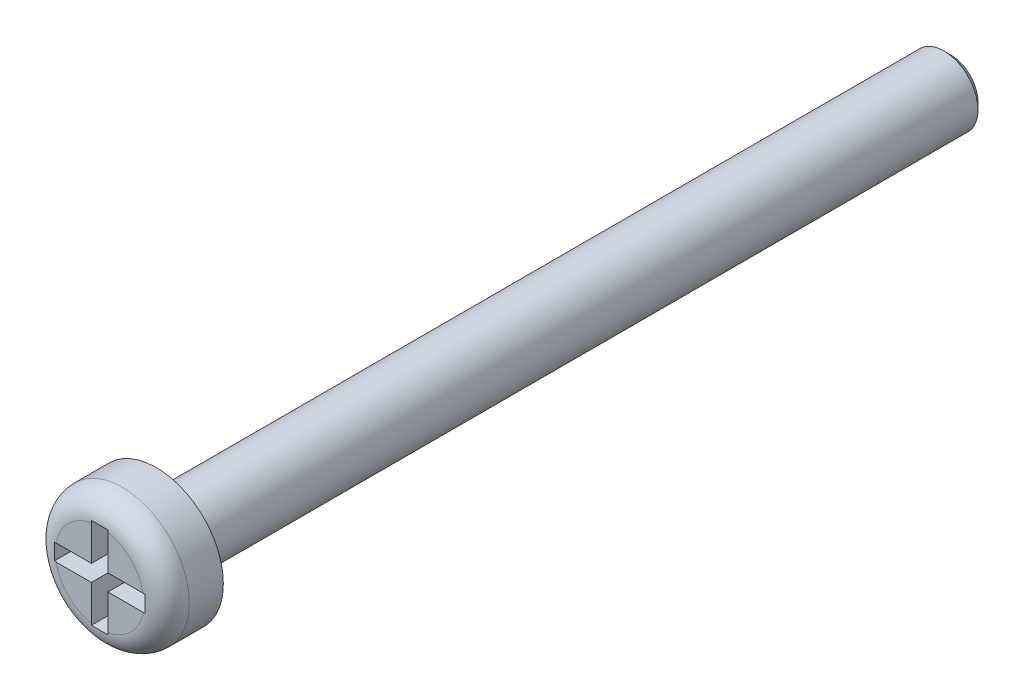
ISO-10303-21;
HEADER;
FILE_DESCRIPTION(('STEP AP214'),'2;1');
FILE_NAME('part.step','',(''),(''),'','','');
FILE_SCHEMA(('AUTOMOTIVE_DESIGN { 1 0 10303 214 1 1 1 1 }'));
ENDSEC;
DATA;
#1=APPLICATION_CONTEXT('core data for automotive mechanical design processes');
#2=APPLICATION_PROTOCOL_DEFINITION('international standard','automotive_design',2000,#1);
#3=PRODUCT_CONTEXT('',#1,'mechanical');
#4=PRODUCT('Part','Part','',(#3));
#5=PRODUCT_RELATED_PRODUCT_CATEGORY('part','',(#4));
#6=PRODUCT_DEFINITION_FORMATION('','',#4);
#7=PRODUCT_DEFINITION_CONTEXT('part definition',#1,'design');
#8=PRODUCT_DEFINITION('design','',#6,#7);
#9=PRODUCT_DEFINITION_SHAPE('','',#8);
#10=(LENGTH_UNIT() NAMED_UNIT(*) SI_UNIT(.MILLI.,.METRE.));
#11=(NAMED_UNIT(*) PLANE_ANGLE_UNIT() SI_UNIT($,.RADIAN.));
#12=(NAMED_UNIT(*) SI_UNIT($,.STERADIAN.) SOLID_ANGLE_UNIT());
#13=UNCERTAINTY_MEASURE_WITH_UNIT(LENGTH_MEASURE(1.E-05),#10,'distance_accuracy_value','');
#14=(GEOMETRIC_REPRESENTATION_CONTEXT(3) GLOBAL_UNCERTAINTY_ASSIGNED_CONTEXT((#13)) GLOBAL_UNIT_ASSIGNED_CONTEXT((#10,
#11,#12)) REPRESENTATION_CONTEXT('',''));
#15=CARTESIAN_POINT('',(0.,0.,0.));
#16=DIRECTION('',(0.,0.,1.));
#17=DIRECTION('',(1.,0.,0.));
#18=AXIS2_PLACEMENT_3D('',#15,#16,#17);
#19=CARTESIAN_POINT('',(0.,0.,2.5));
#20=DIRECTION('',(0.,0.,1.));
#21=DIRECTION('',(1.,0.,0.));
#22=AXIS2_PLACEMENT_3D('',#19,#20,#21);
#23=PLANE('',#22);
#24=DIRECTION('',(0.,-1.,0.));
#25=VECTOR('',#24,1.);
#26=CARTESIAN_POINT('',(-0.363589324194442,0.363589324194443,2.5));
#27=LINE('',#26,#25);
#28=CARTESIAN_POINT('',(-0.363589324194442,1.915803435463,2.5));
#29=VERTEX_POINT('',#28);
#30=CARTESIAN_POINT('',(-0.363589324194442,0.363589324194443,2.5));
#31=VERTEX_POINT('',#30);
#32=EDGE_CURVE('E215',#29,#31,#27,.T.);
#33=ORIENTED_EDGE('',*,*,#32,.F.);
#34=CARTESIAN_POINT('',(0.,0.,2.5));
#35=DIRECTION('',(0.,0.,1.));
#36=DIRECTION('',(1.,0.,0.));
#37=AXIS2_PLACEMENT_3D('',#34,#35,#36);
#38=CIRCLE('',#37,1.95);
#39=CARTESIAN_POINT('',(-1.915803435463,0.363589324194443,2.5));
#40=VERTEX_POINT('',#39);
#41=EDGE_CURVE('E267',#29,#40,#38,.T.);
#42=ORIENTED_EDGE('',*,*,#41,.T.);
#43=DIRECTION('',(-1.,0.,0.));
#44=VECTOR('',#43,1.);
#45=CARTESIAN_POINT('',(-2.,0.363589324194443,2.5));
#46=LINE('',#45,#44);
#47=EDGE_CURVE('E217',#31,#40,#46,.T.);
#48=ORIENTED_EDGE('',*,*,#47,.F.);
#49=EDGE_LOOP('',(#33,#42,#48));
#50=FACE_BOUND('',#49,.T.);
#51=ADVANCED_FACE('F35',(#50),#23,.T.);
#52=DIRECTION('',(1.,0.,0.));
#53=VECTOR('',#52,1.);
#54=CARTESIAN_POINT('',(-2.,-0.363589324194442,2.5));
#55=LINE('',#54,#53);
#56=CARTESIAN_POINT('',(-1.915803435463,-0.363589324194442,2.5));
#57=VERTEX_POINT('',#56);
#58=CARTESIAN_POINT('',(-0.363589324194442,-0.363589324194442,2.5));
#59=VERTEX_POINT('',#58);
#60=EDGE_CURVE('E180',#57,#59,#55,.T.);
#61=ORIENTED_EDGE('',*,*,#60,.F.);
#62=CARTESIAN_POINT('',(0.,0.,2.5));
#63=DIRECTION('',(0.,0.,1.));
#64=DIRECTION('',(1.,0.,0.));
#65=AXIS2_PLACEMENT_3D('',#62,#63,#64);
#66=CIRCLE('',#65,1.95);
#67=CARTESIAN_POINT('',(-0.363589324194442,-1.915803435463,2.5));
#68=VERTEX_POINT('',#67);
#69=EDGE_CURVE('E265',#57,#68,#66,.T.);
#70=ORIENTED_EDGE('',*,*,#69,.T.);
#71=DIRECTION('',(0.,-1.,0.));
#72=VECTOR('',#71,1.);
#73=CARTESIAN_POINT('',(-0.363589324194442,-2.,2.5));
#74=LINE('',#73,#72);
#75=EDGE_CURVE('E177',#59,#68,#74,.T.);
#76=ORIENTED_EDGE('',*,*,#75,.F.);
#77=EDGE_LOOP('',(#61,#70,#76));
#78=FACE_BOUND('',#77,.T.);
#79=ADVANCED_FACE('F384',(#78),#23,.T.);
#80=DIRECTION('',(0.,1.,0.));
#81=VECTOR('',#80,1.);
#82=CARTESIAN_POINT('',(0.363589324194442,-2.,2.5));
#83=LINE('',#82,#81);
#84=CARTESIAN_POINT('',(0.363589324194442,-1.915803435463,2.5));
#85=VERTEX_POINT('',#84);
#86=CARTESIAN_POINT('',(0.363589324194442,-0.363589324194442,2.5));
#87=VERTEX_POINT('',#86);
#88=EDGE_CURVE('E158',#85,#87,#83,.T.);
#89=ORIENTED_EDGE('',*,*,#88,.F.);
#90=CARTESIAN_POINT('',(0.,0.,2.5));
#91=DIRECTION('',(0.,0.,1.));
#92=DIRECTION('',(1.,0.,0.));
#93=AXIS2_PLACEMENT_3D('',#90,#91,#92);
#94=CIRCLE('',#93,1.95);
#95=CARTESIAN_POINT('',(1.915803435463,-0.363589324194442,2.5));
#96=VERTEX_POINT('',#95);
#97=EDGE_CURVE('E263',#85,#96,#94,.T.);
#98=ORIENTED_EDGE('',*,*,#97,.T.);
#99=DIRECTION('',(1.,0.,0.));
#100=VECTOR('',#99,1.);
#101=CARTESIAN_POINT('',(0.363589324194442,-0.363589324194442,2.5));
#102=LINE('',#101,#100);
#103=EDGE_CURVE('E209',#87,#96,#102,.T.);
#104=ORIENTED_EDGE('',*,*,#103,.F.);
#105=EDGE_LOOP('',(#89,#98,#104));
#106=FACE_BOUND('',#105,.T.);
#107=ADVANCED_FACE('F370',(#106),#23,.T.);
#108=CARTESIAN_POINT('',(0.,0.,0.));
#109=DIRECTION('',(0.,0.,1.));
#110=DIRECTION('',(1.,0.,0.));
#111=AXIS2_PLACEMENT_3D('',#108,#109,#110);
#112=PLANE('',#111);
#113=CARTESIAN_POINT('',(0.,0.,0.));
#114=DIRECTION('',(0.,0.,1.));
#115=DIRECTION('',(1.,0.,0.));
#116=AXIS2_PLACEMENT_3D('',#113,#114,#115);
#117=CIRCLE('',#116,2.95);
#118=CARTESIAN_POINT('',(2.95,0.,0.));
#119=VERTEX_POINT('',#118);
#120=EDGE_CURVE('E223',#119,#119,#117,.T.);
#121=ORIENTED_EDGE('',*,*,#120,.F.);
#122=EDGE_LOOP('',(#121));
#123=FACE_BOUND('',#122,.T.);
#124=CARTESIAN_POINT('',(0.,0.,0.));
#125=DIRECTION('',(0.,0.,1.));
#126=DIRECTION('',(1.,0.,0.));
#127=AXIS2_PLACEMENT_3D('',#124,#125,#126);
#128=CIRCLE('',#127,1.5);
#129=CARTESIAN_POINT('',(1.5,0.,0.));
#130=VERTEX_POINT('',#129);
#131=EDGE_CURVE('E252',#130,#130,#128,.F.);
#132=ORIENTED_EDGE('',*,*,#131,.F.);
#133=EDGE_LOOP('',(#132));
#134=FACE_BOUND('',#133,.T.);
#135=ADVANCED_FACE('F371',(#123,#134),#112,.F.);
#136=CARTESIAN_POINT('',(0.,0.,2.5));
#137=DIRECTION('',(0.,0.,-1.));
#138=DIRECTION('',(-1.,0.,0.));
#139=AXIS2_PLACEMENT_3D('',#136,#137,#138);
#140=CYLINDRICAL_SURFACE('',#139,2.95);
#141=CARTESIAN_POINT('',(0.,0.,1.5));
#142=DIRECTION('',(0.,0.,1.));
#143=DIRECTION('',(1.,0.,0.));
#144=AXIS2_PLACEMENT_3D('',#141,#142,#143);
#145=CIRCLE('',#144,2.95);
#146=CARTESIAN_POINT('',(2.95,0.,1.5));
#147=VERTEX_POINT('',#146);
#148=EDGE_CURVE('E11',#147,#147,#145,.F.);
#149=ORIENTED_EDGE('',*,*,#148,.T.);
#150=EDGE_LOOP('',(#149));
#151=FACE_BOUND('',#150,.T.);
#152=ORIENTED_EDGE('',*,*,#120,.T.);
#153=EDGE_LOOP('',(#152));
#154=FACE_BOUND('',#153,.T.);
#155=ADVANCED_FACE('F368',(#151,#154),#140,.T.);
#156=DIRECTION('',(-1.,0.,0.));
#157=VECTOR('',#156,1.);
#158=CARTESIAN_POINT('',(0.363589324194442,0.363589324194443,2.5));
#159=LINE('',#158,#157);
#160=CARTESIAN_POINT('',(1.915803435463,0.363589324194443,2.5));
#161=VERTEX_POINT('',#160);
#162=CARTESIAN_POINT('',(0.363589324194442,0.363589324194443,2.5));
#163=VERTEX_POINT('',#162);
#164=EDGE_CURVE('E211',#161,#163,#159,.T.);
#165=ORIENTED_EDGE('',*,*,#164,.F.);
#166=CARTESIAN_POINT('',(0.,0.,2.5));
#167=DIRECTION('',(0.,0.,1.));
#168=DIRECTION('',(1.,0.,0.));
#169=AXIS2_PLACEMENT_3D('',#166,#167,#168);
#170=CIRCLE('',#169,1.95);
#171=CARTESIAN_POINT('',(0.363589324194442,1.915803435463,2.5));
#172=VERTEX_POINT('',#171);
#173=EDGE_CURVE('E261',#161,#172,#170,.T.);
#174=ORIENTED_EDGE('',*,*,#173,.T.);
#175=DIRECTION('',(0.,1.,0.));
#176=VECTOR('',#175,1.);
#177=CARTESIAN_POINT('',(0.363589324194442,0.363589324194443,2.5));
#178=LINE('',#177,#176);
#179=EDGE_CURVE('E213',#163,#172,#178,.T.);
#180=ORIENTED_EDGE('',*,*,#179,.F.);
#181=EDGE_LOOP('',(#165,#174,#180));
#182=FACE_BOUND('',#181,.T.);
#183=ADVANCED_FACE('F364',(#182),#23,.T.);
#184=CARTESIAN_POINT('',(0.,0.,-35.));
#185=DIRECTION('',(0.,0.,1.));
#186=DIRECTION('',(1.,0.,0.));
#187=AXIS2_PLACEMENT_3D('',#184,#185,#186);
#188=CYLINDRICAL_SURFACE('',#187,1.5);
#189=CARTESIAN_POINT('',(0.,0.,-34.7));
#190=DIRECTION('',(0.,0.,-1.));
#191=DIRECTION('',(-1.,0.,0.));
#192=AXIS2_PLACEMENT_3D('',#189,#190,#191);
#193=CIRCLE('',#192,1.5);
#194=CARTESIAN_POINT('',(-1.5,0.,-34.7));
#195=VERTEX_POINT('',#194);
#196=EDGE_CURVE('E258',#195,#195,#193,.F.);
#197=ORIENTED_EDGE('',*,*,#196,.T.);
#198=EDGE_LOOP('',(#197));
#199=FACE_BOUND('',#198,.T.);
#200=ORIENTED_EDGE('',*,*,#131,.T.);
#201=EDGE_LOOP('',(#200));
#202=FACE_BOUND('',#201,.T.);
#203=ADVANCED_FACE('F360',(#199,#202),#188,.T.);
#204=CARTESIAN_POINT('',(0.,0.,-35.));
#205=DIRECTION('',(0.,0.,-1.));
#206=DIRECTION('',(-1.,0.,0.));
#207=AXIS2_PLACEMENT_3D('',#204,#205,#206);
#208=PLANE('',#207);
#209=CARTESIAN_POINT('',(0.,0.,-35.));
#210=DIRECTION('',(0.,0.,-1.));
#211=DIRECTION('',(-1.,0.,0.));
#212=AXIS2_PLACEMENT_3D('',#209,#210,#211);
#213=CIRCLE('',#212,1.20000000000001);
#214=CARTESIAN_POINT('',(-1.20000000000001,0.,-35.));
#215=VERTEX_POINT('',#214);
#216=EDGE_CURVE('E255',#215,#215,#213,.T.);
#217=ORIENTED_EDGE('',*,*,#216,.T.);
#218=EDGE_LOOP('',(#217));
#219=FACE_BOUND('',#218,.T.);
#220=ADVANCED_FACE('F357',(#219),#208,.T.);
#221=CARTESIAN_POINT('',(0.,0.,-35.));
#222=DIRECTION('',(0.,0.,1.));
#223=DIRECTION('',(1.,0.,0.));
#224=AXIS2_PLACEMENT_3D('',#221,#222,#223);
#225=CONICAL_SURFACE('',#224,1.20000000000001,0.785398163397435);
#226=ORIENTED_EDGE('',*,*,#196,.F.);
#227=EDGE_LOOP('',(#226));
#228=FACE_BOUND('',#227,.T.);
#229=ORIENTED_EDGE('',*,*,#216,.F.);
#230=EDGE_LOOP('',(#229));
#231=FACE_BOUND('',#230,.T.);
#232=ADVANCED_FACE('F356',(#228,#231),#225,.T.);
#233=CARTESIAN_POINT('',(0.363589324194442,-2.,0.5));
#234=DIRECTION('',(1.,0.,0.));
#235=DIRECTION('',(0.,0.,-1.));
#236=AXIS2_PLACEMENT_3D('',#233,#234,#235);
#237=PLANE('',#236);
#238=DIRECTION('',(0.,0.,1.));
#239=VECTOR('',#238,1.);
#240=CARTESIAN_POINT('',(0.363589324194442,-2.,0.5));
#241=LINE('',#240,#239);
#242=CARTESIAN_POINT('',(0.363589324194442,-2.,0.5));
#243=VERTEX_POINT('',#242);
#244=CARTESIAN_POINT('',(0.363589324194442,-2.,2.49656779144265));
#245=VERTEX_POINT('',#244);
#246=EDGE_CURVE('E221',#243,#245,#241,.T.);
#247=ORIENTED_EDGE('',*,*,#246,.T.);
#248=CARTESIAN_POINT('',(0.363589324194442,-2.,2.49656779144265));
#249=CARTESIAN_POINT('',(0.363589324194442,-1.98599056173165,2.49771205782613));
#250=CARTESIAN_POINT('',(0.363589324194442,-1.97196946017275,2.49857020839763));
#251=CARTESIAN_POINT('',(0.363589324194442,-1.94390393864683,2.49971427758346));
#252=CARTESIAN_POINT('',(0.363589324194442,-1.92985951869339,2.50000019653109));
#253=CARTESIAN_POINT('',(0.363589324194442,-1.915803435463,2.5));
#254=B_SPLINE_CURVE_WITH_KNOTS('',3,(#248,#249,#250,#251,#252,#253),.UNSPECIFIED.,.F.,.F.,(4,2,
4),(0.,0.0421420146878945,0.084284004831425),.UNSPECIFIED.);
#255=EDGE_CURVE('E341',#245,#85,#254,.T.);
#256=ORIENTED_EDGE('',*,*,#255,.T.);
#257=ORIENTED_EDGE('',*,*,#88,.T.);
#258=DIRECTION('',(0.,0.,1.));
#259=VECTOR('',#258,1.);
#260=CARTESIAN_POINT('',(0.363589324194442,-0.363589324194442,0.5));
#261=LINE('',#260,#259);
#262=CARTESIAN_POINT('',(0.363589324194442,-0.363589324194442,0.5));
#263=VERTEX_POINT('',#262);
#264=EDGE_CURVE('E150',#263,#87,#261,.T.);
#265=ORIENTED_EDGE('',*,*,#264,.F.);
#266=DIRECTION('',(0.,1.,0.));
#267=VECTOR('',#266,1.);
#268=CARTESIAN_POINT('',(0.363589324194442,-2.,0.5));
#269=LINE('',#268,#267);
#270=EDGE_CURVE('E155',#243,#263,#269,.T.);
#271=ORIENTED_EDGE('',*,*,#270,.F.);
#272=EDGE_LOOP('',(#247,#256,#257,#265,#271));
#273=FACE_BOUND('',#272,.T.);
#274=ADVANCED_FACE('F153',(#273),#237,.F.);
#275=CARTESIAN_POINT('',(-0.363589324194442,-2.,0.5));
#276=DIRECTION('',(0.,-1.,0.));
#277=DIRECTION('',(0.,0.,-1.));
#278=AXIS2_PLACEMENT_3D('',#275,#276,#277);
#279=PLANE('',#278);
#280=DIRECTION('',(0.,0.,1.));
#281=VECTOR('',#280,1.);
#282=CARTESIAN_POINT('',(-0.363589324194442,-2.,0.5));
#283=LINE('',#282,#281);
#284=CARTESIAN_POINT('',(-0.363589324194442,-2.,0.5));
#285=VERTEX_POINT('',#284);
#286=CARTESIAN_POINT('',(-0.363589324194442,-2.,2.49656779144265));
#287=VERTEX_POINT('',#286);
#288=EDGE_CURVE('E224',#285,#287,#283,.T.);
#289=ORIENTED_EDGE('',*,*,#288,.T.);
#290=CARTESIAN_POINT('',(-0.363589324194442,-2.,2.49656779144265));
#291=CARTESIAN_POINT('',(-0.302993422672167,-2.,2.4974261728027));
#292=CARTESIAN_POINT('',(-0.242394946107263,-2.,2.49797153365682));
#293=CARTESIAN_POINT('',(-0.12119764629845,-2.,2.4986330482506));
#294=CARTESIAN_POINT('',(-0.060598823149225,-2.,2.49874921777191));
#295=CARTESIAN_POINT('',(0.0605988231492249,-2.,2.49874921777191));
#296=CARTESIAN_POINT('',(0.12119764629845,-2.,2.4986330482506));
#297=CARTESIAN_POINT('',(0.242394946107262,-2.,2.49797153365682));
#298=CARTESIAN_POINT('',(0.302993422672167,-2.,2.4974261728027));
#299=CARTESIAN_POINT('',(0.363589324194442,-2.,2.49656779144265));
#300=B_SPLINE_CURVE_WITH_KNOTS('',3,(#290,#291,#292,#293,#294,#295,#296,#297,#298,#299),
.UNSPECIFIED.,.F.,.F.,(4,2,2,2,4),(0.,0.181802416457,0.363598147850277,0.545393879243555,
0.727196295700555),.UNSPECIFIED.);
#301=EDGE_CURVE('E346',#287,#245,#300,.T.);
#302=ORIENTED_EDGE('',*,*,#301,.T.);
#303=ORIENTED_EDGE('',*,*,#246,.F.);
#304=DIRECTION('',(1.,0.,0.));
#305=VECTOR('',#304,1.);
#306=CARTESIAN_POINT('',(-0.363589324194442,-2.,0.5));
#307=LINE('',#306,#305);
#308=EDGE_CURVE('E163',#285,#243,#307,.T.);
#309=ORIENTED_EDGE('',*,*,#308,.F.);
#310=EDGE_LOOP('',(#289,#302,#303,#309));
#311=FACE_BOUND('',#310,.T.);
#312=ADVANCED_FACE('F355',(#311),#279,.F.);
#313=CARTESIAN_POINT('',(-0.363589324194442,-2.,0.5));
#314=DIRECTION('',(-1.,0.,0.));
#315=DIRECTION('',(0.,-1.,0.));
#316=AXIS2_PLACEMENT_3D('',#313,#314,#315);
#317=PLANE('',#316);
#318=ORIENTED_EDGE('',*,*,#75,.T.);
#319=CARTESIAN_POINT('',(-0.363589324194442,-1.915803435463,2.5));
#320=CARTESIAN_POINT('',(-0.363589324194442,-1.92985951869339,2.50000019653109));
#321=CARTESIAN_POINT('',(-0.363589324194442,-1.94390393864683,2.49971427758346));
#322=CARTESIAN_POINT('',(-0.363589324194442,-1.97196946017275,2.49857020839763));
#323=CARTESIAN_POINT('',(-0.363589324194442,-1.98599056173165,2.49771205782613));
#324=CARTESIAN_POINT('',(-0.363589324194442,-2.,2.49656779144265));
#325=B_SPLINE_CURVE_WITH_KNOTS('',3,(#319,#320,#321,#322,#323,#324),.UNSPECIFIED.,.F.,.F.,(4,2,
4),(0.,0.0421419901435307,0.0842840048314248),.UNSPECIFIED.);
#326=EDGE_CURVE('E560',#68,#287,#325,.T.);
#327=ORIENTED_EDGE('',*,*,#326,.T.);
#328=ORIENTED_EDGE('',*,*,#288,.F.);
#329=DIRECTION('',(0.,-1.,0.));
#330=VECTOR('',#329,1.);
#331=CARTESIAN_POINT('',(-0.363589324194442,-2.,0.5));
#332=LINE('',#331,#330);
#333=CARTESIAN_POINT('',(-0.363589324194442,-0.363589324194442,0.5));
#334=VERTEX_POINT('',#333);
#335=EDGE_CURVE('E205',#334,#285,#332,.T.);
#336=ORIENTED_EDGE('',*,*,#335,.F.);
#337=DIRECTION('',(0.,0.,1.));
#338=VECTOR('',#337,1.);
#339=CARTESIAN_POINT('',(-0.363589324194442,-0.363589324194442,0.5));
#340=LINE('',#339,#338);
#341=EDGE_CURVE('E227',#334,#59,#340,.T.);
#342=ORIENTED_EDGE('',*,*,#341,.T.);
#343=EDGE_LOOP('',(#318,#327,#328,#336,#342));
#344=FACE_BOUND('',#343,.T.);
#345=ADVANCED_FACE('F532',(#344),#317,.F.);
#346=CARTESIAN_POINT('',(-2.,-0.363589324194442,0.5));
#347=DIRECTION('',(0.,-1.,0.));
#348=DIRECTION('',(0.,0.,-1.));
#349=AXIS2_PLACEMENT_3D('',#346,#347,#348);
#350=PLANE('',#349);
#351=DIRECTION('',(0.,0.,1.));
#352=VECTOR('',#351,1.);
#353=CARTESIAN_POINT('',(-2.,-0.363589324194442,0.5));
#354=LINE('',#353,#352);
#355=CARTESIAN_POINT('',(-2.,-0.363589324194442,0.5));
#356=VERTEX_POINT('',#355);
#357=CARTESIAN_POINT('',(-2.,-0.363589324194442,2.49656779144265));
#358=VERTEX_POINT('',#357);
#359=EDGE_CURVE('E230',#356,#358,#354,.T.);
#360=ORIENTED_EDGE('',*,*,#359,.T.);
#361=CARTESIAN_POINT('',(-2.,-0.363589324194442,2.49656779144265));
#362=CARTESIAN_POINT('',(-1.98599056173165,-0.363589324194442,2.49771205782613));
#363=CARTESIAN_POINT('',(-1.97196946017275,-0.363589324194442,2.49857020839763));
#364=CARTESIAN_POINT('',(-1.94390393864683,-0.363589324194442,2.49971427758346));
#365=CARTESIAN_POINT('',(-1.92985951869339,-0.363589324194442,2.50000019653109));
#366=CARTESIAN_POINT('',(-1.915803435463,-0.363589324194442,2.5));
#367=B_SPLINE_CURVE_WITH_KNOTS('',3,(#361,#362,#363,#364,#365,#366),.UNSPECIFIED.,.F.,.F.,(4,2,
4),(0.,0.0421420146878945,0.0842840048314257),.UNSPECIFIED.);
#368=EDGE_CURVE('E564',#358,#57,#367,.T.);
#369=ORIENTED_EDGE('',*,*,#368,.T.);
#370=ORIENTED_EDGE('',*,*,#60,.T.);
#371=ORIENTED_EDGE('',*,*,#341,.F.);
#372=DIRECTION('',(1.,0.,0.));
#373=VECTOR('',#372,1.);
#374=CARTESIAN_POINT('',(-2.,-0.363589324194442,0.5));
#375=LINE('',#374,#373);
#376=EDGE_CURVE('E202',#356,#334,#375,.T.);
#377=ORIENTED_EDGE('',*,*,#376,.F.);
#378=EDGE_LOOP('',(#360,#369,#370,#371,#377));
#379=FACE_BOUND('',#378,.T.);
#380=ADVANCED_FACE('F524',(#379),#350,.F.);
#381=CARTESIAN_POINT('',(-2.,-0.363589324194442,0.5));
#382=DIRECTION('',(-1.,0.,0.));
#383=DIRECTION('',(0.,0.,1.));
#384=AXIS2_PLACEMENT_3D('',#381,#382,#383);
#385=PLANE('',#384);
#386=DIRECTION('',(0.,0.,1.));
#387=VECTOR('',#386,1.);
#388=CARTESIAN_POINT('',(-2.,0.363589324194443,0.5));
#389=LINE('',#388,#387);
#390=CARTESIAN_POINT('',(-2.,0.363589324194443,0.5));
#391=VERTEX_POINT('',#390);
#392=CARTESIAN_POINT('',(-2.,0.363589324194443,2.49656779144265));
#393=VERTEX_POINT('',#392);
#394=EDGE_CURVE('E233',#391,#393,#389,.T.);
#395=ORIENTED_EDGE('',*,*,#394,.T.);
#396=CARTESIAN_POINT('',(-2.,0.363589324194443,2.49656779144265));
#397=CARTESIAN_POINT('',(-2.,0.302993422672167,2.4974261728027));
#398=CARTESIAN_POINT('',(-2.,0.242394946107263,2.49797153365682));
#399=CARTESIAN_POINT('',(-2.,0.12119764629845,2.4986330482506));
#400=CARTESIAN_POINT('',(-2.,0.0605988231492253,2.49874921777191));
#401=CARTESIAN_POINT('',(-2.,-0.0605988231492247,2.49874921777191));
#402=CARTESIAN_POINT('',(-2.,-0.12119764629845,2.4986330482506));
#403=CARTESIAN_POINT('',(-2.,-0.242394946107262,2.49797153365682));
#404=CARTESIAN_POINT('',(-2.,-0.302993422672167,2.4974261728027));
#405=CARTESIAN_POINT('',(-2.,-0.363589324194442,2.49656779144265));
#406=B_SPLINE_CURVE_WITH_KNOTS('',3,(#396,#397,#398,#399,#400,#401,#402,#403,#404,#405),
.UNSPECIFIED.,.F.,.F.,(4,2,2,2,4),(0.,0.181802416457,0.363598147850278,0.545393879243555,
0.727196295700555),.UNSPECIFIED.);
#407=EDGE_CURVE('E276',#393,#358,#406,.T.);
#408=ORIENTED_EDGE('',*,*,#407,.T.);
#409=ORIENTED_EDGE('',*,*,#359,.F.);
#410=DIRECTION('',(0.,-1.,0.));
#411=VECTOR('',#410,1.);
#412=CARTESIAN_POINT('',(-2.,-0.363589324194442,0.5));
#413=LINE('',#412,#411);
#414=EDGE_CURVE('E199',#391,#356,#413,.T.);
#415=ORIENTED_EDGE('',*,*,#414,.F.);
#416=EDGE_LOOP('',(#395,#408,#409,#415));
#417=FACE_BOUND('',#416,.T.);
#418=ADVANCED_FACE('F287',(#417),#385,.F.);
#419=CARTESIAN_POINT('',(-2.,0.363589324194443,0.5));
#420=DIRECTION('',(0.,1.,0.));
#421=DIRECTION('',(0.,0.,1.));
#422=AXIS2_PLACEMENT_3D('',#419,#420,#421);
#423=PLANE('',#422);
#424=ORIENTED_EDGE('',*,*,#47,.T.);
#425=CARTESIAN_POINT('',(-1.915803435463,0.363589324194443,2.5));
#426=CARTESIAN_POINT('',(-1.92985951869339,0.363589324194443,2.50000019653109));
#427=CARTESIAN_POINT('',(-1.94390393864683,0.363589324194443,2.49971427758346));
#428=CARTESIAN_POINT('',(-1.97196946017275,0.363589324194443,2.49857020839763));
#429=CARTESIAN_POINT('',(-1.98599056173165,0.363589324194443,2.49771205782613));
#430=CARTESIAN_POINT('',(-2.,0.363589324194443,2.49656779144265));
#431=B_SPLINE_CURVE_WITH_KNOTS('',3,(#425,#426,#427,#428,#429,#430),.UNSPECIFIED.,.F.,.F.,(4,2,
4),(0.,0.0421419901435309,0.0842840048314254),.UNSPECIFIED.);
#432=EDGE_CURVE('E270',#40,#393,#431,.T.);
#433=ORIENTED_EDGE('',*,*,#432,.T.);
#434=ORIENTED_EDGE('',*,*,#394,.F.);
#435=DIRECTION('',(-1.,0.,0.));
#436=VECTOR('',#435,1.);
#437=CARTESIAN_POINT('',(-2.,0.363589324194443,0.5));
#438=LINE('',#437,#436);
#439=CARTESIAN_POINT('',(-0.363589324194442,0.363589324194443,0.5));
#440=VERTEX_POINT('',#439);
#441=EDGE_CURVE('E196',#440,#391,#438,.T.);
#442=ORIENTED_EDGE('',*,*,#441,.F.);
#443=DIRECTION('',(0.,0.,1.));
#444=VECTOR('',#443,1.);
#445=CARTESIAN_POINT('',(-0.363589324194442,0.363589324194443,0.5));
#446=LINE('',#445,#444);
#447=EDGE_CURVE('E236',#440,#31,#446,.T.);
#448=ORIENTED_EDGE('',*,*,#447,.T.);
#449=EDGE_LOOP('',(#424,#433,#434,#442,#448));
#450=FACE_BOUND('',#449,.T.);
#451=ADVANCED_FACE('F282',(#450),#423,.F.);
#452=CARTESIAN_POINT('',(-0.363589324194442,0.363589324194443,0.5));
#453=DIRECTION('',(-1.,0.,0.));
#454=DIRECTION('',(0.,-1.,0.));
#455=AXIS2_PLACEMENT_3D('',#452,#453,#454);
#456=PLANE('',#455);
#457=DIRECTION('',(0.,0.,1.));
#458=VECTOR('',#457,1.);
#459=CARTESIAN_POINT('',(-0.363589324194442,2.,0.5));
#460=LINE('',#459,#458);
#461=CARTESIAN_POINT('',(-0.363589324194442,2.,0.5));
#462=VERTEX_POINT('',#461);
#463=CARTESIAN_POINT('',(-0.363589324194442,2.,2.49656779144265));
#464=VERTEX_POINT('',#463);
#465=EDGE_CURVE('E239',#462,#464,#460,.T.);
#466=ORIENTED_EDGE('',*,*,#465,.T.);
#467=CARTESIAN_POINT('',(-0.363589324194442,2.,2.49656779144265));
#468=CARTESIAN_POINT('',(-0.363589324194442,1.98599056173165,2.49771205782613));
#469=CARTESIAN_POINT('',(-0.363589324194442,1.97196946017275,2.49857020839763));
#470=CARTESIAN_POINT('',(-0.363589324194442,1.94390393864683,2.49971427758346));
#471=CARTESIAN_POINT('',(-0.363589324194442,1.92985951869339,2.50000019653109));
#472=CARTESIAN_POINT('',(-0.363589324194442,1.915803435463,2.5));
#473=B_SPLINE_CURVE_WITH_KNOTS('',3,(#467,#468,#469,#470,#471,#472),.UNSPECIFIED.,.F.,.F.,(4,2,
4),(0.,0.0421420146878945,0.084284004831425),.UNSPECIFIED.);
#474=EDGE_CURVE('E44',#464,#29,#473,.T.);
#475=ORIENTED_EDGE('',*,*,#474,.T.);
#476=ORIENTED_EDGE('',*,*,#32,.T.);
#477=ORIENTED_EDGE('',*,*,#447,.F.);
#478=DIRECTION('',(0.,-1.,0.));
#479=VECTOR('',#478,1.);
#480=CARTESIAN_POINT('',(-0.363589324194442,0.363589324194443,0.5));
#481=LINE('',#480,#479);
#482=EDGE_CURVE('E193',#462,#440,#481,.T.);
#483=ORIENTED_EDGE('',*,*,#482,.F.);
#484=EDGE_LOOP('',(#466,#475,#476,#477,#483));
#485=FACE_BOUND('',#484,.T.);
#486=ADVANCED_FACE('F286',(#485),#456,.F.);
#487=CARTESIAN_POINT('',(-0.363589324194442,2.,0.5));
#488=DIRECTION('',(0.,1.,0.));
#489=DIRECTION('',(0.,0.,1.));
#490=AXIS2_PLACEMENT_3D('',#487,#488,#489);
#491=PLANE('',#490);
#492=DIRECTION('',(0.,0.,1.));
#493=VECTOR('',#492,1.);
#494=CARTESIAN_POINT('',(0.363589324194442,2.,0.5));
#495=LINE('',#494,#493);
#496=CARTESIAN_POINT('',(0.363589324194442,2.,0.5));
#497=VERTEX_POINT('',#496);
#498=CARTESIAN_POINT('',(0.363589324194442,2.,2.49656779144265));
#499=VERTEX_POINT('',#498);
#500=EDGE_CURVE('E241',#497,#499,#495,.T.);
#501=ORIENTED_EDGE('',*,*,#500,.T.);
#502=CARTESIAN_POINT('',(0.363589324194442,2.,2.49656779144265));
#503=CARTESIAN_POINT('',(0.302993422672167,2.,2.4974261728027));
#504=CARTESIAN_POINT('',(0.242394946107263,2.,2.49797153365682));
#505=CARTESIAN_POINT('',(0.12119764629845,2.,2.4986330482506));
#506=CARTESIAN_POINT('',(0.0605988231492249,2.,2.49874921777191));
#507=CARTESIAN_POINT('',(-0.060598823149225,2.,2.49874921777191));
#508=CARTESIAN_POINT('',(-0.12119764629845,2.,2.4986330482506));
#509=CARTESIAN_POINT('',(-0.242394946107263,2.,2.49797153365682));
#510=CARTESIAN_POINT('',(-0.302993422672167,2.,2.4974261728027));
#511=CARTESIAN_POINT('',(-0.363589324194442,2.,2.49656779144265));
#512=B_SPLINE_CURVE_WITH_KNOTS('',3,(#502,#503,#504,#505,#506,#507,#508,#509,#510,#511),
.UNSPECIFIED.,.F.,.F.,(4,2,2,2,4),(0.,0.181802416457,0.363598147850278,0.545393879243555,
0.727196295700555),.UNSPECIFIED.);
#513=EDGE_CURVE('E51',#499,#464,#512,.T.);
#514=ORIENTED_EDGE('',*,*,#513,.T.);
#515=ORIENTED_EDGE('',*,*,#465,.F.);
#516=DIRECTION('',(-1.,0.,0.));
#517=VECTOR('',#516,1.);
#518=CARTESIAN_POINT('',(-0.363589324194442,2.,0.5));
#519=LINE('',#518,#517);
#520=EDGE_CURVE('E190',#497,#462,#519,.T.);
#521=ORIENTED_EDGE('',*,*,#520,.F.);
#522=EDGE_LOOP('',(#501,#514,#515,#521));
#523=FACE_BOUND('',#522,.T.);
#524=ADVANCED_FACE('F294',(#523),#491,.F.);
#525=CARTESIAN_POINT('',(0.363589324194442,0.363589324194443,0.5));
#526=DIRECTION('',(1.,0.,0.));
#527=DIRECTION('',(0.,0.,-1.));
#528=AXIS2_PLACEMENT_3D('',#525,#526,#527);
#529=PLANE('',#528);
#530=ORIENTED_EDGE('',*,*,#179,.T.);
#531=CARTESIAN_POINT('',(0.363589324194442,1.915803435463,2.5));
#532=CARTESIAN_POINT('',(0.363589324194442,1.92985951869339,2.50000019653109));
#533=CARTESIAN_POINT('',(0.363589324194442,1.94390393864683,2.49971427758346));
#534=CARTESIAN_POINT('',(0.363589324194442,1.97196946017275,2.49857020839763));
#535=CARTESIAN_POINT('',(0.363589324194442,1.98599056173165,2.49771205782613));
#536=CARTESIAN_POINT('',(0.363589324194442,2.,2.49656779144265));
#537=B_SPLINE_CURVE_WITH_KNOTS('',3,(#531,#532,#533,#534,#535,#536),.UNSPECIFIED.,.F.,.F.,(4,2,
4),(0.,0.0421419901435307,0.0842840048314248),.UNSPECIFIED.);
#538=EDGE_CURVE('E59',#172,#499,#537,.T.);
#539=ORIENTED_EDGE('',*,*,#538,.T.);
#540=ORIENTED_EDGE('',*,*,#500,.F.);
#541=DIRECTION('',(0.,1.,0.));
#542=VECTOR('',#541,1.);
#543=CARTESIAN_POINT('',(0.363589324194442,0.363589324194443,0.5));
#544=LINE('',#543,#542);
#545=CARTESIAN_POINT('',(0.363589324194442,0.363589324194443,0.5));
#546=VERTEX_POINT('',#545);
#547=EDGE_CURVE('E187',#546,#497,#544,.T.);
#548=ORIENTED_EDGE('',*,*,#547,.F.);
#549=DIRECTION('',(0.,0.,1.));
#550=VECTOR('',#549,1.);
#551=CARTESIAN_POINT('',(0.363589324194442,0.363589324194443,0.5));
#552=LINE('',#551,#550);
#553=EDGE_CURVE('E243',#546,#163,#552,.T.);
#554=ORIENTED_EDGE('',*,*,#553,.T.);
#555=EDGE_LOOP('',(#530,#539,#540,#548,#554));
#556=FACE_BOUND('',#555,.T.);
#557=ADVANCED_FACE('F316',(#556),#529,.F.);
#558=CARTESIAN_POINT('',(0.363589324194442,0.363589324194443,0.5));
#559=DIRECTION('',(0.,1.,0.));
#560=DIRECTION('',(0.,0.,1.));
#561=AXIS2_PLACEMENT_3D('',#558,#559,#560);
#562=PLANE('',#561);
#563=DIRECTION('',(0.,0.,1.));
#564=VECTOR('',#563,1.);
#565=CARTESIAN_POINT('',(2.,0.363589324194443,0.5));
#566=LINE('',#565,#564);
#567=CARTESIAN_POINT('',(2.,0.363589324194443,0.5));
#568=VERTEX_POINT('',#567);
#569=CARTESIAN_POINT('',(2.,0.363589324194443,2.49656779144265));
#570=VERTEX_POINT('',#569);
#571=EDGE_CURVE('E246',#568,#570,#566,.T.);
#572=ORIENTED_EDGE('',*,*,#571,.T.);
#573=CARTESIAN_POINT('',(2.,0.363589324194443,2.49656779144265));
#574=CARTESIAN_POINT('',(1.98599056173165,0.363589324194443,2.49771205782613));
#575=CARTESIAN_POINT('',(1.97196946017275,0.363589324194443,2.49857020839763));
#576=CARTESIAN_POINT('',(1.94390393864683,0.363589324194443,2.49971427758346));
#577=CARTESIAN_POINT('',(1.92985951869339,0.363589324194443,2.50000019653109));
#578=CARTESIAN_POINT('',(1.915803435463,0.363589324194443,2.5));
#579=B_SPLINE_CURVE_WITH_KNOTS('',3,(#573,#574,#575,#576,#577,#578),.UNSPECIFIED.,.F.,.F.,(4,2,
4),(0.,0.0421420146878945,0.0842840048314257),.UNSPECIFIED.);
#580=EDGE_CURVE('E310',#570,#161,#579,.T.);
#581=ORIENTED_EDGE('',*,*,#580,.T.);
#582=ORIENTED_EDGE('',*,*,#164,.T.);
#583=ORIENTED_EDGE('',*,*,#553,.F.);
#584=DIRECTION('',(-1.,0.,0.));
#585=VECTOR('',#584,1.);
#586=CARTESIAN_POINT('',(0.363589324194442,0.363589324194443,0.5));
#587=LINE('',#586,#585);
#588=EDGE_CURVE('E184',#568,#546,#587,.T.);
#589=ORIENTED_EDGE('',*,*,#588,.F.);
#590=EDGE_LOOP('',(#572,#581,#582,#583,#589));
#591=FACE_BOUND('',#590,.T.);
#592=ADVANCED_FACE('F319',(#591),#562,.F.);
#593=CARTESIAN_POINT('',(2.,-0.363589324194442,0.5));
#594=DIRECTION('',(1.,0.,0.));
#595=DIRECTION('',(0.,0.,-1.));
#596=AXIS2_PLACEMENT_3D('',#593,#594,#595);
#597=PLANE('',#596);
#598=DIRECTION('',(0.,0.,1.));
#599=VECTOR('',#598,1.);
#600=CARTESIAN_POINT('',(2.,-0.363589324194442,0.5));
#601=LINE('',#600,#599);
#602=CARTESIAN_POINT('',(2.,-0.363589324194442,0.5));
#603=VERTEX_POINT('',#602);
#604=CARTESIAN_POINT('',(2.,-0.363589324194442,2.49656779144265));
#605=VERTEX_POINT('',#604);
#606=EDGE_CURVE('E162',#603,#605,#601,.T.);
#607=ORIENTED_EDGE('',*,*,#606,.T.);
#608=CARTESIAN_POINT('',(2.,-0.363589324194442,2.49656779144265));
#609=CARTESIAN_POINT('',(2.,-0.302993422672167,2.4974261728027));
#610=CARTESIAN_POINT('',(2.,-0.242394946107262,2.49797153365682));
#611=CARTESIAN_POINT('',(2.,-0.12119764629845,2.4986330482506));
#612=CARTESIAN_POINT('',(2.,-0.0605988231492247,2.49874921777191));
#613=CARTESIAN_POINT('',(2.,0.0605988231492252,2.49874921777191));
#614=CARTESIAN_POINT('',(2.,0.12119764629845,2.4986330482506));
#615=CARTESIAN_POINT('',(2.,0.242394946107263,2.49797153365682));
#616=CARTESIAN_POINT('',(2.,0.302993422672167,2.4974261728027));
#617=CARTESIAN_POINT('',(2.,0.363589324194443,2.49656779144265));
#618=B_SPLINE_CURVE_WITH_KNOTS('',3,(#608,#609,#610,#611,#612,#613,#614,#615,#616,#617),
.UNSPECIFIED.,.F.,.F.,(4,2,2,2,4),(0.,0.181802416457,0.363598147850278,0.545393879243555,
0.727196295700555),.UNSPECIFIED.);
#619=EDGE_CURVE('E331',#605,#570,#618,.T.);
#620=ORIENTED_EDGE('',*,*,#619,.T.);
#621=ORIENTED_EDGE('',*,*,#571,.F.);
#622=DIRECTION('',(0.,1.,0.));
#623=VECTOR('',#622,1.);
#624=CARTESIAN_POINT('',(2.,-0.363589324194442,0.5));
#625=LINE('',#624,#623);
#626=EDGE_CURVE('E172',#603,#568,#625,.T.);
#627=ORIENTED_EDGE('',*,*,#626,.F.);
#628=EDGE_LOOP('',(#607,#620,#621,#627));
#629=FACE_BOUND('',#628,.T.);
#630=ADVANCED_FACE('F323',(#629),#597,.F.);
#631=CARTESIAN_POINT('',(0.363589324194442,-0.363589324194442,0.5));
#632=DIRECTION('',(0.,-1.,0.));
#633=DIRECTION('',(0.,0.,-1.));
#634=AXIS2_PLACEMENT_3D('',#631,#632,#633);
#635=PLANE('',#634);
#636=ORIENTED_EDGE('',*,*,#103,.T.);
#637=CARTESIAN_POINT('',(1.915803435463,-0.363589324194442,2.5));
#638=CARTESIAN_POINT('',(1.92985951869339,-0.363589324194442,2.50000019653109));
#639=CARTESIAN_POINT('',(1.94390393864683,-0.363589324194442,2.49971427758346));
#640=CARTESIAN_POINT('',(1.97196946017275,-0.363589324194442,2.49857020839763));
#641=CARTESIAN_POINT('',(1.98599056173165,-0.363589324194442,2.49771205782613));
#642=CARTESIAN_POINT('',(2.,-0.363589324194442,2.49656779144265));
#643=B_SPLINE_CURVE_WITH_KNOTS('',3,(#637,#638,#639,#640,#641,#642),.UNSPECIFIED.,.F.,.F.,(4,2,
4),(0.,0.0421419901435309,0.0842840048314254),.UNSPECIFIED.);
#644=EDGE_CURVE('E336',#96,#605,#643,.T.);
#645=ORIENTED_EDGE('',*,*,#644,.T.);
#646=ORIENTED_EDGE('',*,*,#606,.F.);
#647=DIRECTION('',(1.,0.,0.));
#648=VECTOR('',#647,1.);
#649=CARTESIAN_POINT('',(0.363589324194442,-0.363589324194442,0.5));
#650=LINE('',#649,#648);
#651=EDGE_CURVE('E166',#263,#603,#650,.T.);
#652=ORIENTED_EDGE('',*,*,#651,.F.);
#653=ORIENTED_EDGE('',*,*,#264,.T.);
#654=EDGE_LOOP('',(#636,#645,#646,#652,#653));
#655=FACE_BOUND('',#654,.T.);
#656=ADVANCED_FACE('F167',(#655),#635,.F.);
#657=CARTESIAN_POINT('',(0.,0.,0.5));
#658=DIRECTION('',(0.,0.,-1.));
#659=DIRECTION('',(-1.,0.,0.));
#660=AXIS2_PLACEMENT_3D('',#657,#658,#659);
#661=PLANE('',#660);
#662=ORIENTED_EDGE('',*,*,#270,.T.);
#663=ORIENTED_EDGE('',*,*,#651,.T.);
#664=ORIENTED_EDGE('',*,*,#626,.T.);
#665=ORIENTED_EDGE('',*,*,#588,.T.);
#666=ORIENTED_EDGE('',*,*,#547,.T.);
#667=ORIENTED_EDGE('',*,*,#520,.T.);
#668=ORIENTED_EDGE('',*,*,#482,.T.);
#669=ORIENTED_EDGE('',*,*,#441,.T.);
#670=ORIENTED_EDGE('',*,*,#414,.T.);
#671=ORIENTED_EDGE('',*,*,#376,.T.);
#672=ORIENTED_EDGE('',*,*,#335,.T.);
#673=ORIENTED_EDGE('',*,*,#308,.T.);
#674=EDGE_LOOP('',(#662,#663,#664,#665,#666,#667,#668,#669,#670,#671,#672,#673));
#675=FACE_BOUND('',#674,.T.);
#676=ADVANCED_FACE('F174',(#675),#661,.F.);
#677=CARTESIAN_POINT('',(0.,0.,1.5));
#678=DIRECTION('',(0.,0.,1.));
#679=DIRECTION('',(1.,0.,0.));
#680=AXIS2_PLACEMENT_3D('',#677,#678,#679);
#681=TOROIDAL_SURFACE('',#680,1.95,1.);
#682=ORIENTED_EDGE('',*,*,#148,.F.);
#683=EDGE_LOOP('',(#682));
#684=FACE_BOUND('',#683,.T.);
#685=ORIENTED_EDGE('',*,*,#432,.F.);
#686=ORIENTED_EDGE('',*,*,#41,.F.);
#687=ORIENTED_EDGE('',*,*,#474,.F.);
#688=ORIENTED_EDGE('',*,*,#513,.F.);
#689=ORIENTED_EDGE('',*,*,#538,.F.);
#690=ORIENTED_EDGE('',*,*,#173,.F.);
#691=ORIENTED_EDGE('',*,*,#580,.F.);
#692=ORIENTED_EDGE('',*,*,#619,.F.);
#693=ORIENTED_EDGE('',*,*,#644,.F.);
#694=ORIENTED_EDGE('',*,*,#97,.F.);
#695=ORIENTED_EDGE('',*,*,#255,.F.);
#696=ORIENTED_EDGE('',*,*,#301,.F.);
#697=ORIENTED_EDGE('',*,*,#326,.F.);
#698=ORIENTED_EDGE('',*,*,#69,.F.);
#699=ORIENTED_EDGE('',*,*,#368,.F.);
#700=ORIENTED_EDGE('',*,*,#407,.F.);
#701=EDGE_LOOP('',(#685,#686,#687,#688,#689,#690,#691,#692,#693,#694,#695,#696,#697,#698,#699,#700));
#702=FACE_BOUND('',#701,.T.);
#703=ADVANCED_FACE('F37',(#684,#702),#681,.T.);
#704=CLOSED_SHELL('',(#51,#79,#107,#135,#155,#183,#203,#220,#232,#274,#312,#345,#380,#418,#451,
#486,#524,#557,#592,#630,#656,#676,#703));
#705=MANIFOLD_SOLID_BREP('B2',#704);
#706=ADVANCED_BREP_SHAPE_REPRESENTATION('',(#18,#705),#14);
#707=SHAPE_DEFINITION_REPRESENTATION(#9,#706);
ENDSEC;
END-ISO-10303-21;
